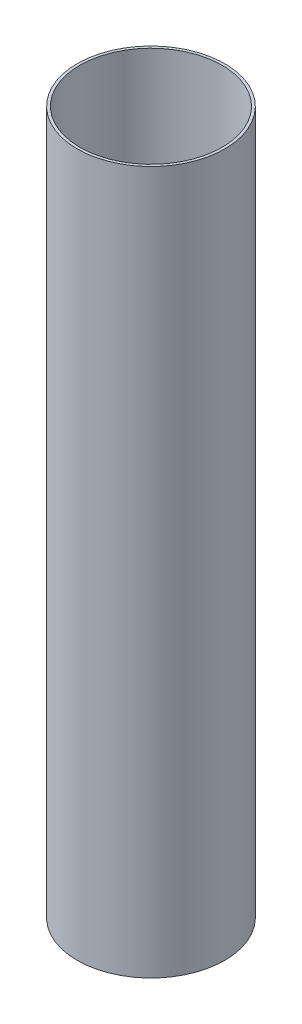
ISO-10303-21;
HEADER;
FILE_DESCRIPTION(('STEP AP214'),'2;1');
FILE_NAME('part.step','',(''),(''),'','','');
FILE_SCHEMA(('AUTOMOTIVE_DESIGN { 1 0 10303 214 1 1 1 1 }'));
ENDSEC;
DATA;
#1=APPLICATION_CONTEXT('core data for automotive mechanical design processes');
#2=APPLICATION_PROTOCOL_DEFINITION('international standard','automotive_design',2000,#1);
#3=PRODUCT_CONTEXT('',#1,'mechanical');
#4=PRODUCT('Part','Part','',(#3));
#5=PRODUCT_RELATED_PRODUCT_CATEGORY('part','',(#4));
#6=PRODUCT_DEFINITION_FORMATION('','',#4);
#7=PRODUCT_DEFINITION_CONTEXT('part definition',#1,'design');
#8=PRODUCT_DEFINITION('design','',#6,#7);
#9=PRODUCT_DEFINITION_SHAPE('','',#8);
#10=(LENGTH_UNIT() NAMED_UNIT(*) SI_UNIT(.MILLI.,.METRE.));
#11=(NAMED_UNIT(*) PLANE_ANGLE_UNIT() SI_UNIT($,.RADIAN.));
#12=(NAMED_UNIT(*) SI_UNIT($,.STERADIAN.) SOLID_ANGLE_UNIT());
#13=UNCERTAINTY_MEASURE_WITH_UNIT(LENGTH_MEASURE(1.E-05),#10,'distance_accuracy_value','');
#14=(GEOMETRIC_REPRESENTATION_CONTEXT(3) GLOBAL_UNCERTAINTY_ASSIGNED_CONTEXT((#13)) GLOBAL_UNIT_ASSIGNED_CONTEXT((#10,
#11,#12)) REPRESENTATION_CONTEXT('',''));
#15=CARTESIAN_POINT('',(0.,0.,0.));
#16=DIRECTION('',(0.,0.,1.));
#17=DIRECTION('',(1.,0.,0.));
#18=AXIS2_PLACEMENT_3D('',#15,#16,#17);
#19=CARTESIAN_POINT('',(0.,114.25,0.));
#20=DIRECTION('',(0.,-1.,0.));
#21=DIRECTION('',(0.,0.,-1.));
#22=AXIS2_PLACEMENT_3D('',#19,#20,#21);
#23=CYLINDRICAL_SURFACE('',#22,12.);
#24=CARTESIAN_POINT('',(0.,114.25,0.));
#25=DIRECTION('',(0.,1.,0.));
#26=DIRECTION('',(0.,0.,1.));
#27=AXIS2_PLACEMENT_3D('',#24,#25,#26);
#28=CIRCLE('',#27,12.);
#29=CARTESIAN_POINT('',(0.,114.25,12.));
#30=VERTEX_POINT('',#29);
#31=EDGE_CURVE('E10',#30,#30,#28,.T.);
#32=ORIENTED_EDGE('',*,*,#31,.F.);
#33=EDGE_LOOP('',(#32));
#34=FACE_BOUND('',#33,.T.);
#35=CARTESIAN_POINT('',(0.,0.,0.));
#36=DIRECTION('',(0.,1.,0.));
#37=DIRECTION('',(0.,0.,1.));
#38=AXIS2_PLACEMENT_3D('',#35,#36,#37);
#39=CIRCLE('',#38,12.);
#40=CARTESIAN_POINT('',(0.,0.,12.));
#41=VERTEX_POINT('',#40);
#42=EDGE_CURVE('E45',#41,#41,#39,.T.);
#43=ORIENTED_EDGE('',*,*,#42,.T.);
#44=EDGE_LOOP('',(#43));
#45=FACE_BOUND('',#44,.T.);
#46=ADVANCED_FACE('F37',(#34,#45),#23,.T.);
#47=CARTESIAN_POINT('',(0.,114.25,0.));
#48=DIRECTION('',(0.,1.,0.));
#49=DIRECTION('',(0.,0.,1.));
#50=AXIS2_PLACEMENT_3D('',#47,#48,#49);
#51=PLANE('',#50);
#52=CARTESIAN_POINT('',(0.,114.25,0.));
#53=DIRECTION('',(0.,1.,0.));
#54=DIRECTION('',(0.,0.,1.));
#55=AXIS2_PLACEMENT_3D('',#52,#53,#54);
#56=CIRCLE('',#55,11.565);
#57=CARTESIAN_POINT('',(0.,114.25,11.565));
#58=VERTEX_POINT('',#57);
#59=EDGE_CURVE('E53',#58,#58,#56,.T.);
#60=ORIENTED_EDGE('',*,*,#59,.F.);
#61=EDGE_LOOP('',(#60));
#62=FACE_BOUND('',#61,.T.);
#63=ORIENTED_EDGE('',*,*,#31,.T.);
#64=EDGE_LOOP('',(#63));
#65=FACE_BOUND('',#64,.T.);
#66=ADVANCED_FACE('F85',(#62,#65),#51,.T.);
#67=CARTESIAN_POINT('',(0.,0.,0.));
#68=DIRECTION('',(0.,1.,0.));
#69=DIRECTION('',(0.,0.,1.));
#70=AXIS2_PLACEMENT_3D('',#67,#68,#69);
#71=PLANE('',#70);
#72=CARTESIAN_POINT('',(0.,0.,0.));
#73=DIRECTION('',(0.,1.,0.));
#74=DIRECTION('',(0.,0.,1.));
#75=AXIS2_PLACEMENT_3D('',#72,#73,#74);
#76=CIRCLE('',#75,3.3);
#77=CARTESIAN_POINT('',(0.,0.,3.3));
#78=VERTEX_POINT('',#77);
#79=EDGE_CURVE('E57',#78,#78,#76,.T.);
#80=ORIENTED_EDGE('',*,*,#79,.T.);
#81=EDGE_LOOP('',(#80));
#82=FACE_BOUND('',#81,.T.);
#83=ORIENTED_EDGE('',*,*,#42,.F.);
#84=EDGE_LOOP('',(#83));
#85=FACE_BOUND('',#84,.T.);
#86=ADVANCED_FACE('F81',(#82,#85),#71,.F.);
#87=CARTESIAN_POINT('',(0.,74.25,0.));
#88=DIRECTION('',(0.,1.,0.));
#89=DIRECTION('',(0.,0.,1.));
#90=AXIS2_PLACEMENT_3D('',#87,#88,#89);
#91=CYLINDRICAL_SURFACE('',#90,11.565);
#92=CARTESIAN_POINT('',(0.,74.25,0.));
#93=DIRECTION('',(0.,1.,0.));
#94=DIRECTION('',(0.,0.,1.));
#95=AXIS2_PLACEMENT_3D('',#92,#93,#94);
#96=CIRCLE('',#95,11.565);
#97=CARTESIAN_POINT('',(0.,74.25,11.565));
#98=VERTEX_POINT('',#97);
#99=EDGE_CURVE('E51',#98,#98,#96,.T.);
#100=ORIENTED_EDGE('',*,*,#99,.F.);
#101=EDGE_LOOP('',(#100));
#102=FACE_BOUND('',#101,.T.);
#103=ORIENTED_EDGE('',*,*,#59,.T.);
#104=EDGE_LOOP('',(#103));
#105=FACE_BOUND('',#104,.T.);
#106=ADVANCED_FACE('F75',(#102,#105),#91,.F.);
#107=CARTESIAN_POINT('',(0.,74.25,0.));
#108=DIRECTION('',(0.,1.,0.));
#109=DIRECTION('',(0.,0.,1.));
#110=AXIS2_PLACEMENT_3D('',#107,#108,#109);
#111=PLANE('',#110);
#112=CARTESIAN_POINT('',(0.,74.25,0.));
#113=DIRECTION('',(0.,1.,0.));
#114=DIRECTION('',(0.,0.,1.));
#115=AXIS2_PLACEMENT_3D('',#112,#113,#114);
#116=CIRCLE('',#115,3.3);
#117=CARTESIAN_POINT('',(0.,74.25,3.3));
#118=VERTEX_POINT('',#117);
#119=EDGE_CURVE('E40',#118,#118,#116,.T.);
#120=ORIENTED_EDGE('',*,*,#119,.F.);
#121=EDGE_LOOP('',(#120));
#122=FACE_BOUND('',#121,.T.);
#123=ORIENTED_EDGE('',*,*,#99,.T.);
#124=EDGE_LOOP('',(#123));
#125=FACE_BOUND('',#124,.T.);
#126=ADVANCED_FACE('F72',(#122,#125),#111,.T.);
#127=CARTESIAN_POINT('',(0.,114.25,0.));
#128=DIRECTION('',(0.,-1.,0.));
#129=DIRECTION('',(0.,0.,-1.));
#130=AXIS2_PLACEMENT_3D('',#127,#128,#129);
#131=CYLINDRICAL_SURFACE('',#130,3.3);
#132=ORIENTED_EDGE('',*,*,#119,.T.);
#133=EDGE_LOOP('',(#132));
#134=FACE_BOUND('',#133,.T.);
#135=ORIENTED_EDGE('',*,*,#79,.F.);
#136=EDGE_LOOP('',(#135));
#137=FACE_BOUND('',#136,.T.);
#138=ADVANCED_FACE('F69',(#134,#137),#131,.F.);
#139=CLOSED_SHELL('',(#46,#66,#86,#106,#126,#138));
#140=MANIFOLD_SOLID_BREP('B2',#139);
#141=ADVANCED_BREP_SHAPE_REPRESENTATION('',(#18,#140),#14);
#142=SHAPE_DEFINITION_REPRESENTATION(#9,#141);
ENDSEC;
END-ISO-10303-21;
